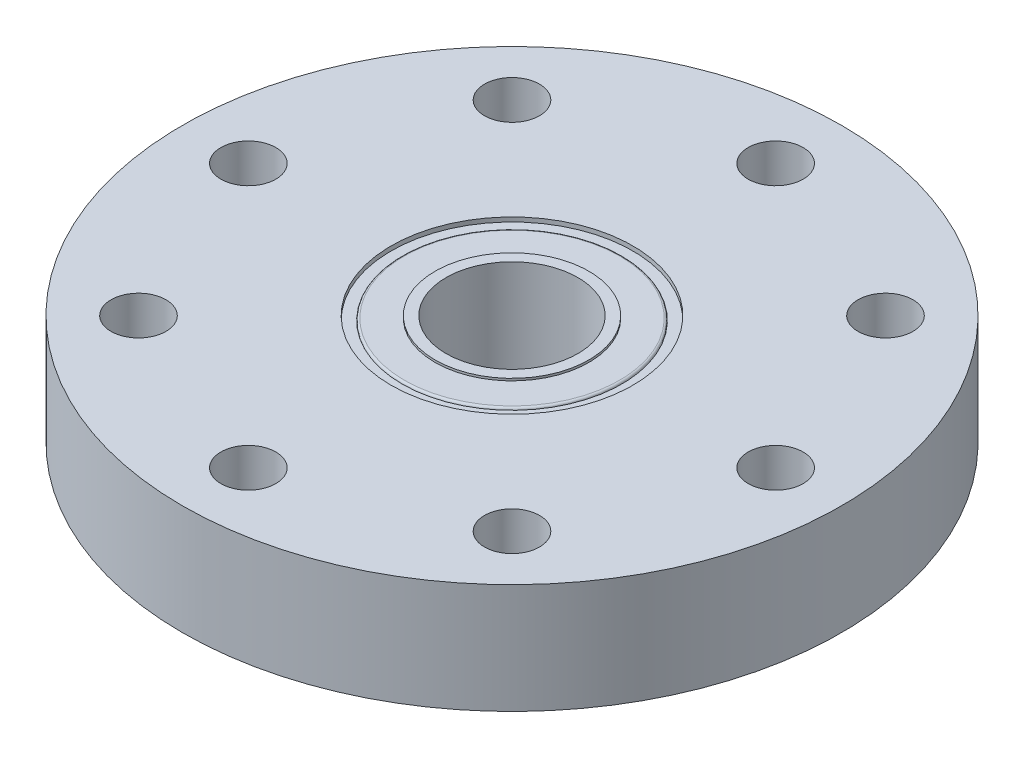
ISO-10303-21;
HEADER;
FILE_DESCRIPTION(('STEP AP214'),'2;1');
FILE_NAME('part.step','',(''),(''),'','','');
FILE_SCHEMA(('AUTOMOTIVE_DESIGN { 1 0 10303 214 1 1 1 1 }'));
ENDSEC;
DATA;
#1=APPLICATION_CONTEXT('core data for automotive mechanical design processes');
#2=APPLICATION_PROTOCOL_DEFINITION('international standard','automotive_design',2000,#1);
#3=PRODUCT_CONTEXT('',#1,'mechanical');
#4=PRODUCT('Part','Part','',(#3));
#5=PRODUCT_RELATED_PRODUCT_CATEGORY('part','',(#4));
#6=PRODUCT_DEFINITION_FORMATION('','',#4);
#7=PRODUCT_DEFINITION_CONTEXT('part definition',#1,'design');
#8=PRODUCT_DEFINITION('design','',#6,#7);
#9=PRODUCT_DEFINITION_SHAPE('','',#8);
#10=(LENGTH_UNIT() NAMED_UNIT(*) SI_UNIT(.MILLI.,.METRE.));
#11=(NAMED_UNIT(*) PLANE_ANGLE_UNIT() SI_UNIT($,.RADIAN.));
#12=(NAMED_UNIT(*) SI_UNIT($,.STERADIAN.) SOLID_ANGLE_UNIT());
#13=UNCERTAINTY_MEASURE_WITH_UNIT(LENGTH_MEASURE(1.E-05),#10,'distance_accuracy_value','');
#14=(GEOMETRIC_REPRESENTATION_CONTEXT(3) GLOBAL_UNCERTAINTY_ASSIGNED_CONTEXT((#13)) GLOBAL_UNIT_ASSIGNED_CONTEXT((#10,
#11,#12)) REPRESENTATION_CONTEXT('',''));
#15=CARTESIAN_POINT('',(0.,0.,0.));
#16=DIRECTION('',(0.,0.,1.));
#17=DIRECTION('',(1.,0.,0.));
#18=AXIS2_PLACEMENT_3D('',#15,#16,#17);
#19=CARTESIAN_POINT('',(0.,0.,0.));
#20=DIRECTION('',(0.,1.,0.));
#21=DIRECTION('',(0.,0.,1.));
#22=AXIS2_PLACEMENT_3D('',#19,#20,#21);
#23=PLANE('',#22);
#24=CARTESIAN_POINT('',(0.,0.,0.));
#25=DIRECTION('',(0.,1.,0.));
#26=DIRECTION('',(0.,0.,1.));
#27=AXIS2_PLACEMENT_3D('',#24,#25,#26);
#28=CIRCLE('',#27,3.);
#29=CARTESIAN_POINT('',(0.,0.,3.));
#30=VERTEX_POINT('',#29);
#31=EDGE_CURVE('E72',#30,#30,#28,.T.);
#32=ORIENTED_EDGE('',*,*,#31,.T.);
#33=EDGE_LOOP('',(#32));
#34=FACE_BOUND('',#33,.T.);
#35=CARTESIAN_POINT('',(0.,0.,0.));
#36=DIRECTION('',(0.,-1.,0.));
#37=DIRECTION('',(0.,0.,-1.));
#38=AXIS2_PLACEMENT_3D('',#35,#36,#37);
#39=CIRCLE('',#38,3.5);
#40=CARTESIAN_POINT('',(0.,0.,-3.5));
#41=VERTEX_POINT('',#40);
#42=EDGE_CURVE('E123',#41,#41,#39,.T.);
#43=ORIENTED_EDGE('',*,*,#42,.T.);
#44=EDGE_LOOP('',(#43));
#45=FACE_BOUND('',#44,.T.);
#46=ADVANCED_FACE('F33',(#34,#45),#23,.F.);
#47=CARTESIAN_POINT('',(0.,5.,0.));
#48=DIRECTION('',(0.,1.,0.));
#49=DIRECTION('',(0.,0.,1.));
#50=AXIS2_PLACEMENT_3D('',#47,#48,#49);
#51=PLANE('',#50);
#52=CARTESIAN_POINT('',(0.,5.,0.));
#53=DIRECTION('',(0.,1.,0.));
#54=DIRECTION('',(0.,0.,1.));
#55=AXIS2_PLACEMENT_3D('',#52,#53,#54);
#56=CIRCLE('',#55,3.);
#57=CARTESIAN_POINT('',(0.,5.,3.));
#58=VERTEX_POINT('',#57);
#59=EDGE_CURVE('E69',#58,#58,#56,.T.);
#60=ORIENTED_EDGE('',*,*,#59,.F.);
#61=EDGE_LOOP('',(#60));
#62=FACE_BOUND('',#61,.T.);
#63=CARTESIAN_POINT('',(0.,5.,0.));
#64=DIRECTION('',(0.,1.,0.));
#65=DIRECTION('',(0.,0.,1.));
#66=AXIS2_PLACEMENT_3D('',#63,#64,#65);
#67=CIRCLE('',#66,3.5);
#68=CARTESIAN_POINT('',(0.,5.,3.5));
#69=VERTEX_POINT('',#68);
#70=EDGE_CURVE('E117',#69,#69,#67,.T.);
#71=ORIENTED_EDGE('',*,*,#70,.T.);
#72=EDGE_LOOP('',(#71));
#73=FACE_BOUND('',#72,.T.);
#74=ADVANCED_FACE('F195',(#62,#73),#51,.T.);
#75=CARTESIAN_POINT('',(0.,5.,0.));
#76=DIRECTION('',(0.,1.,0.));
#77=DIRECTION('',(0.,0.,1.));
#78=AXIS2_PLACEMENT_3D('',#75,#76,#77);
#79=CIRCLE('',#78,5.5);
#80=CARTESIAN_POINT('',(0.,5.,5.5));
#81=VERTEX_POINT('',#80);
#82=EDGE_CURVE('E108',#81,#81,#79,.T.);
#83=ORIENTED_EDGE('',*,*,#82,.F.);
#84=EDGE_LOOP('',(#83));
#85=FACE_BOUND('',#84,.T.);
#86=CARTESIAN_POINT('',(-8.49999999999999,5.,8.50000000000049));
#87=DIRECTION('',(0.,1.,0.));
#88=DIRECTION('',(0.,0.,1.));
#89=AXIS2_PLACEMENT_3D('',#86,#87,#88);
#90=CIRCLE('',#89,1.25);
#91=CARTESIAN_POINT('',(-8.49999999999999,5.,9.75000000000049));
#92=VERTEX_POINT('',#91);
#93=EDGE_CURVE('E93',#92,#92,#90,.T.);
#94=ORIENTED_EDGE('',*,*,#93,.F.);
#95=EDGE_LOOP('',(#94));
#96=FACE_BOUND('',#95,.T.);
#97=CARTESIAN_POINT('',(8.5,5.,-8.49999999999952));
#98=DIRECTION('',(0.,1.,0.));
#99=DIRECTION('',(0.,0.,1.));
#100=AXIS2_PLACEMENT_3D('',#97,#98,#99);
#101=CIRCLE('',#100,1.25);
#102=CARTESIAN_POINT('',(8.5,5.,-7.24999999999952));
#103=VERTEX_POINT('',#102);
#104=EDGE_CURVE('E81',#103,#103,#101,.T.);
#105=ORIENTED_EDGE('',*,*,#104,.F.);
#106=EDGE_LOOP('',(#105));
#107=FACE_BOUND('',#106,.T.);
#108=CARTESIAN_POINT('',(0.,5.,12.));
#109=DIRECTION('',(0.,1.,0.));
#110=DIRECTION('',(0.,0.,1.));
#111=AXIS2_PLACEMENT_3D('',#108,#109,#110);
#112=CIRCLE('',#111,1.25);
#113=CARTESIAN_POINT('',(0.,5.,13.25));
#114=VERTEX_POINT('',#113);
#115=EDGE_CURVE('E57',#114,#114,#112,.T.);
#116=ORIENTED_EDGE('',*,*,#115,.F.);
#117=EDGE_LOOP('',(#116));
#118=FACE_BOUND('',#117,.T.);
#119=CARTESIAN_POINT('',(0.,5.,0.));
#120=DIRECTION('',(0.,1.,0.));
#121=DIRECTION('',(0.,0.,1.));
#122=AXIS2_PLACEMENT_3D('',#119,#120,#121);
#123=CIRCLE('',#122,15.);
#124=CARTESIAN_POINT('',(0.,5.,15.));
#125=VERTEX_POINT('',#124);
#126=EDGE_CURVE('E44',#125,#125,#123,.T.);
#127=ORIENTED_EDGE('',*,*,#126,.T.);
#128=EDGE_LOOP('',(#127));
#129=FACE_BOUND('',#128,.T.);
#130=CARTESIAN_POINT('',(0.,5.,-12.));
#131=DIRECTION('',(0.,1.,0.));
#132=DIRECTION('',(0.,0.,1.));
#133=AXIS2_PLACEMENT_3D('',#130,#131,#132);
#134=CIRCLE('',#133,1.25);
#135=CARTESIAN_POINT('',(0.,5.,-10.75));
#136=VERTEX_POINT('',#135);
#137=EDGE_CURVE('E52',#136,#136,#134,.T.);
#138=ORIENTED_EDGE('',*,*,#137,.F.);
#139=EDGE_LOOP('',(#138));
#140=FACE_BOUND('',#139,.T.);
#141=CARTESIAN_POINT('',(-12.,5.,0.));
#142=DIRECTION('',(0.,1.,0.));
#143=DIRECTION('',(0.,0.,1.));
#144=AXIS2_PLACEMENT_3D('',#141,#142,#143);
#145=CIRCLE('',#144,1.25);
#146=CARTESIAN_POINT('',(-12.,5.,1.25));
#147=VERTEX_POINT('',#146);
#148=EDGE_CURVE('E63',#147,#147,#145,.T.);
#149=ORIENTED_EDGE('',*,*,#148,.F.);
#150=EDGE_LOOP('',(#149));
#151=FACE_BOUND('',#150,.T.);
#152=CARTESIAN_POINT('',(12.,5.,0.));
#153=DIRECTION('',(0.,1.,0.));
#154=DIRECTION('',(0.,0.,1.));
#155=AXIS2_PLACEMENT_3D('',#152,#153,#154);
#156=CIRCLE('',#155,1.25);
#157=CARTESIAN_POINT('',(12.,5.,1.25));
#158=VERTEX_POINT('',#157);
#159=EDGE_CURVE('E75',#158,#158,#156,.T.);
#160=ORIENTED_EDGE('',*,*,#159,.F.);
#161=EDGE_LOOP('',(#160));
#162=FACE_BOUND('',#161,.T.);
#163=CARTESIAN_POINT('',(8.50000000000001,5.,8.50000000000049));
#164=DIRECTION('',(0.,1.,0.));
#165=DIRECTION('',(0.,0.,1.));
#166=AXIS2_PLACEMENT_3D('',#163,#164,#165);
#167=CIRCLE('',#166,1.25);
#168=CARTESIAN_POINT('',(8.50000000000001,5.,9.75000000000049));
#169=VERTEX_POINT('',#168);
#170=EDGE_CURVE('E87',#169,#169,#167,.T.);
#171=ORIENTED_EDGE('',*,*,#170,.F.);
#172=EDGE_LOOP('',(#171));
#173=FACE_BOUND('',#172,.T.);
#174=CARTESIAN_POINT('',(-8.5,5.,-8.49999999999952));
#175=DIRECTION('',(0.,1.,0.));
#176=DIRECTION('',(0.,0.,1.));
#177=AXIS2_PLACEMENT_3D('',#174,#175,#176);
#178=CIRCLE('',#177,1.25);
#179=CARTESIAN_POINT('',(-8.5,5.,-7.24999999999952));
#180=VERTEX_POINT('',#179);
#181=EDGE_CURVE('E99',#180,#180,#178,.T.);
#182=ORIENTED_EDGE('',*,*,#181,.F.);
#183=EDGE_LOOP('',(#182));
#184=FACE_BOUND('',#183,.T.);
#185=ADVANCED_FACE('F158',(#85,#96,#107,#118,#129,#140,#151,#162,#173,#184),#51,.T.);
#186=CARTESIAN_POINT('',(0.,0.,0.));
#187=DIRECTION('',(0.,-1.,0.));
#188=DIRECTION('',(0.,0.,-1.));
#189=AXIS2_PLACEMENT_3D('',#186,#187,#188);
#190=CIRCLE('',#189,5.75);
#191=CARTESIAN_POINT('',(0.,0.,-5.75));
#192=VERTEX_POINT('',#191);
#193=EDGE_CURVE('E129',#192,#192,#190,.T.);
#194=ORIENTED_EDGE('',*,*,#193,.F.);
#195=EDGE_LOOP('',(#194));
#196=FACE_BOUND('',#195,.T.);
#197=CARTESIAN_POINT('',(0.,0.,0.));
#198=DIRECTION('',(0.,1.,0.));
#199=DIRECTION('',(0.,0.,1.));
#200=AXIS2_PLACEMENT_3D('',#197,#198,#199);
#201=CIRCLE('',#200,15.);
#202=CARTESIAN_POINT('',(0.,0.,15.));
#203=VERTEX_POINT('',#202);
#204=EDGE_CURVE('E48',#203,#203,#201,.T.);
#205=ORIENTED_EDGE('',*,*,#204,.F.);
#206=EDGE_LOOP('',(#205));
#207=FACE_BOUND('',#206,.T.);
#208=CARTESIAN_POINT('',(0.,0.,-12.));
#209=DIRECTION('',(0.,1.,0.));
#210=DIRECTION('',(0.,0.,1.));
#211=AXIS2_PLACEMENT_3D('',#208,#209,#210);
#212=CIRCLE('',#211,1.25);
#213=CARTESIAN_POINT('',(0.,0.,-10.75));
#214=VERTEX_POINT('',#213);
#215=EDGE_CURVE('E54',#214,#214,#212,.T.);
#216=ORIENTED_EDGE('',*,*,#215,.T.);
#217=EDGE_LOOP('',(#216));
#218=FACE_BOUND('',#217,.T.);
#219=CARTESIAN_POINT('',(0.,0.,12.));
#220=DIRECTION('',(0.,1.,0.));
#221=DIRECTION('',(0.,0.,1.));
#222=AXIS2_PLACEMENT_3D('',#219,#220,#221);
#223=CIRCLE('',#222,1.25);
#224=CARTESIAN_POINT('',(0.,0.,13.25));
#225=VERTEX_POINT('',#224);
#226=EDGE_CURVE('E60',#225,#225,#223,.T.);
#227=ORIENTED_EDGE('',*,*,#226,.T.);
#228=EDGE_LOOP('',(#227));
#229=FACE_BOUND('',#228,.T.);
#230=CARTESIAN_POINT('',(-12.,0.,0.));
#231=DIRECTION('',(0.,1.,0.));
#232=DIRECTION('',(0.,0.,1.));
#233=AXIS2_PLACEMENT_3D('',#230,#231,#232);
#234=CIRCLE('',#233,1.25);
#235=CARTESIAN_POINT('',(-12.,0.,1.25));
#236=VERTEX_POINT('',#235);
#237=EDGE_CURVE('E66',#236,#236,#234,.T.);
#238=ORIENTED_EDGE('',*,*,#237,.T.);
#239=EDGE_LOOP('',(#238));
#240=FACE_BOUND('',#239,.T.);
#241=CARTESIAN_POINT('',(12.,0.,0.));
#242=DIRECTION('',(0.,1.,0.));
#243=DIRECTION('',(0.,0.,1.));
#244=AXIS2_PLACEMENT_3D('',#241,#242,#243);
#245=CIRCLE('',#244,1.25);
#246=CARTESIAN_POINT('',(12.,0.,1.25));
#247=VERTEX_POINT('',#246);
#248=EDGE_CURVE('E78',#247,#247,#245,.T.);
#249=ORIENTED_EDGE('',*,*,#248,.T.);
#250=EDGE_LOOP('',(#249));
#251=FACE_BOUND('',#250,.T.);
#252=CARTESIAN_POINT('',(8.5,0.,-8.49999999999952));
#253=DIRECTION('',(0.,1.,0.));
#254=DIRECTION('',(0.,0.,1.));
#255=AXIS2_PLACEMENT_3D('',#252,#253,#254);
#256=CIRCLE('',#255,1.25);
#257=CARTESIAN_POINT('',(8.5,0.,-7.24999999999952));
#258=VERTEX_POINT('',#257);
#259=EDGE_CURVE('E84',#258,#258,#256,.T.);
#260=ORIENTED_EDGE('',*,*,#259,.T.);
#261=EDGE_LOOP('',(#260));
#262=FACE_BOUND('',#261,.T.);
#263=CARTESIAN_POINT('',(8.50000000000001,0.,8.50000000000049));
#264=DIRECTION('',(0.,1.,0.));
#265=DIRECTION('',(0.,0.,1.));
#266=AXIS2_PLACEMENT_3D('',#263,#264,#265);
#267=CIRCLE('',#266,1.25);
#268=CARTESIAN_POINT('',(8.50000000000001,0.,9.75000000000049));
#269=VERTEX_POINT('',#268);
#270=EDGE_CURVE('E90',#269,#269,#267,.T.);
#271=ORIENTED_EDGE('',*,*,#270,.T.);
#272=EDGE_LOOP('',(#271));
#273=FACE_BOUND('',#272,.T.);
#274=CARTESIAN_POINT('',(-8.49999999999999,0.,8.50000000000049));
#275=DIRECTION('',(0.,1.,0.));
#276=DIRECTION('',(0.,0.,1.));
#277=AXIS2_PLACEMENT_3D('',#274,#275,#276);
#278=CIRCLE('',#277,1.25);
#279=CARTESIAN_POINT('',(-8.49999999999999,0.,9.75000000000049));
#280=VERTEX_POINT('',#279);
#281=EDGE_CURVE('E96',#280,#280,#278,.T.);
#282=ORIENTED_EDGE('',*,*,#281,.T.);
#283=EDGE_LOOP('',(#282));
#284=FACE_BOUND('',#283,.T.);
#285=CARTESIAN_POINT('',(-8.5,0.,-8.49999999999952));
#286=DIRECTION('',(0.,1.,0.));
#287=DIRECTION('',(0.,0.,1.));
#288=AXIS2_PLACEMENT_3D('',#285,#286,#287);
#289=CIRCLE('',#288,1.25);
#290=CARTESIAN_POINT('',(-8.5,0.,-7.24999999999952));
#291=VERTEX_POINT('',#290);
#292=EDGE_CURVE('E102',#291,#291,#289,.T.);
#293=ORIENTED_EDGE('',*,*,#292,.T.);
#294=EDGE_LOOP('',(#293));
#295=FACE_BOUND('',#294,.T.);
#296=ADVANCED_FACE('F154',(#196,#207,#218,#229,#240,#251,#262,#273,#284,#295),#23,.F.);
#297=CARTESIAN_POINT('',(0.,5.,0.));
#298=DIRECTION('',(0.,-1.,0.));
#299=DIRECTION('',(0.,0.,-1.));
#300=AXIS2_PLACEMENT_3D('',#297,#298,#299);
#301=CYLINDRICAL_SURFACE('',#300,15.);
#302=ORIENTED_EDGE('',*,*,#126,.F.);
#303=EDGE_LOOP('',(#302));
#304=FACE_BOUND('',#303,.T.);
#305=ORIENTED_EDGE('',*,*,#204,.T.);
#306=EDGE_LOOP('',(#305));
#307=FACE_BOUND('',#306,.T.);
#308=ADVANCED_FACE('F157',(#304,#307),#301,.T.);
#309=CARTESIAN_POINT('',(0.,5.,-12.));
#310=DIRECTION('',(0.,-1.,0.));
#311=DIRECTION('',(0.,0.,-1.));
#312=AXIS2_PLACEMENT_3D('',#309,#310,#311);
#313=CYLINDRICAL_SURFACE('',#312,1.25);
#314=ORIENTED_EDGE('',*,*,#137,.T.);
#315=EDGE_LOOP('',(#314));
#316=FACE_BOUND('',#315,.T.);
#317=ORIENTED_EDGE('',*,*,#215,.F.);
#318=EDGE_LOOP('',(#317));
#319=FACE_BOUND('',#318,.T.);
#320=ADVANCED_FACE('F206',(#316,#319),#313,.F.);
#321=CARTESIAN_POINT('',(0.,5.,12.));
#322=DIRECTION('',(0.,-1.,0.));
#323=DIRECTION('',(0.,0.,-1.));
#324=AXIS2_PLACEMENT_3D('',#321,#322,#323);
#325=CYLINDRICAL_SURFACE('',#324,1.25);
#326=ORIENTED_EDGE('',*,*,#115,.T.);
#327=EDGE_LOOP('',(#326));
#328=FACE_BOUND('',#327,.T.);
#329=ORIENTED_EDGE('',*,*,#226,.F.);
#330=EDGE_LOOP('',(#329));
#331=FACE_BOUND('',#330,.T.);
#332=ADVANCED_FACE('F267',(#328,#331),#325,.F.);
#333=CARTESIAN_POINT('',(-12.,5.,0.));
#334=DIRECTION('',(0.,-1.,0.));
#335=DIRECTION('',(0.,0.,-1.));
#336=AXIS2_PLACEMENT_3D('',#333,#334,#335);
#337=CYLINDRICAL_SURFACE('',#336,1.25);
#338=ORIENTED_EDGE('',*,*,#148,.T.);
#339=EDGE_LOOP('',(#338));
#340=FACE_BOUND('',#339,.T.);
#341=ORIENTED_EDGE('',*,*,#237,.F.);
#342=EDGE_LOOP('',(#341));
#343=FACE_BOUND('',#342,.T.);
#344=ADVANCED_FACE('F263',(#340,#343),#337,.F.);
#345=CARTESIAN_POINT('',(0.,5.,0.));
#346=DIRECTION('',(0.,-1.,0.));
#347=DIRECTION('',(0.,0.,-1.));
#348=AXIS2_PLACEMENT_3D('',#345,#346,#347);
#349=CYLINDRICAL_SURFACE('',#348,3.);
#350=ORIENTED_EDGE('',*,*,#59,.T.);
#351=EDGE_LOOP('',(#350));
#352=FACE_BOUND('',#351,.T.);
#353=ORIENTED_EDGE('',*,*,#31,.F.);
#354=EDGE_LOOP('',(#353));
#355=FACE_BOUND('',#354,.T.);
#356=ADVANCED_FACE('F259',(#352,#355),#349,.F.);
#357=CARTESIAN_POINT('',(12.,5.,0.));
#358=DIRECTION('',(0.,-1.,0.));
#359=DIRECTION('',(0.,0.,-1.));
#360=AXIS2_PLACEMENT_3D('',#357,#358,#359);
#361=CYLINDRICAL_SURFACE('',#360,1.25);
#362=ORIENTED_EDGE('',*,*,#159,.T.);
#363=EDGE_LOOP('',(#362));
#364=FACE_BOUND('',#363,.T.);
#365=ORIENTED_EDGE('',*,*,#248,.F.);
#366=EDGE_LOOP('',(#365));
#367=FACE_BOUND('',#366,.T.);
#368=ADVANCED_FACE('F253',(#364,#367),#361,.F.);
#369=CARTESIAN_POINT('',(8.5,5.,-8.49999999999952));
#370=DIRECTION('',(0.,-1.,0.));
#371=DIRECTION('',(0.,0.,-1.));
#372=AXIS2_PLACEMENT_3D('',#369,#370,#371);
#373=CYLINDRICAL_SURFACE('',#372,1.25);
#374=ORIENTED_EDGE('',*,*,#104,.T.);
#375=EDGE_LOOP('',(#374));
#376=FACE_BOUND('',#375,.T.);
#377=ORIENTED_EDGE('',*,*,#259,.F.);
#378=EDGE_LOOP('',(#377));
#379=FACE_BOUND('',#378,.T.);
#380=ADVANCED_FACE('F248',(#376,#379),#373,.F.);
#381=CARTESIAN_POINT('',(8.50000000000001,5.,8.50000000000049));
#382=DIRECTION('',(0.,-1.,0.));
#383=DIRECTION('',(0.,0.,-1.));
#384=AXIS2_PLACEMENT_3D('',#381,#382,#383);
#385=CYLINDRICAL_SURFACE('',#384,1.25);
#386=ORIENTED_EDGE('',*,*,#170,.T.);
#387=EDGE_LOOP('',(#386));
#388=FACE_BOUND('',#387,.T.);
#389=ORIENTED_EDGE('',*,*,#270,.F.);
#390=EDGE_LOOP('',(#389));
#391=FACE_BOUND('',#390,.T.);
#392=ADVANCED_FACE('F191',(#388,#391),#385,.F.);
#393=CARTESIAN_POINT('',(-8.49999999999999,5.,8.50000000000049));
#394=DIRECTION('',(0.,-1.,0.));
#395=DIRECTION('',(0.,0.,-1.));
#396=AXIS2_PLACEMENT_3D('',#393,#394,#395);
#397=CYLINDRICAL_SURFACE('',#396,1.25);
#398=ORIENTED_EDGE('',*,*,#93,.T.);
#399=EDGE_LOOP('',(#398));
#400=FACE_BOUND('',#399,.T.);
#401=ORIENTED_EDGE('',*,*,#281,.F.);
#402=EDGE_LOOP('',(#401));
#403=FACE_BOUND('',#402,.T.);
#404=ADVANCED_FACE('F181',(#400,#403),#397,.F.);
#405=CARTESIAN_POINT('',(-8.5,5.,-8.49999999999952));
#406=DIRECTION('',(0.,-1.,0.));
#407=DIRECTION('',(0.,0.,-1.));
#408=AXIS2_PLACEMENT_3D('',#405,#406,#407);
#409=CYLINDRICAL_SURFACE('',#408,1.25);
#410=ORIENTED_EDGE('',*,*,#181,.T.);
#411=EDGE_LOOP('',(#410));
#412=FACE_BOUND('',#411,.T.);
#413=ORIENTED_EDGE('',*,*,#292,.F.);
#414=EDGE_LOOP('',(#413));
#415=FACE_BOUND('',#414,.T.);
#416=ADVANCED_FACE('F178',(#412,#415),#409,.F.);
#417=CARTESIAN_POINT('',(0.,4.8,0.));
#418=DIRECTION('',(0.,1.,0.));
#419=DIRECTION('',(0.,0.,1.));
#420=AXIS2_PLACEMENT_3D('',#417,#418,#419);
#421=CYLINDRICAL_SURFACE('',#420,5.5);
#422=CARTESIAN_POINT('',(0.,4.8,0.));
#423=DIRECTION('',(0.,1.,0.));
#424=DIRECTION('',(0.,0.,1.));
#425=AXIS2_PLACEMENT_3D('',#422,#423,#424);
#426=CIRCLE('',#425,5.5);
#427=CARTESIAN_POINT('',(0.,4.8,5.5));
#428=VERTEX_POINT('',#427);
#429=EDGE_CURVE('E105',#428,#428,#426,.T.);
#430=ORIENTED_EDGE('',*,*,#429,.F.);
#431=EDGE_LOOP('',(#430));
#432=FACE_BOUND('',#431,.T.);
#433=ORIENTED_EDGE('',*,*,#82,.T.);
#434=EDGE_LOOP('',(#433));
#435=FACE_BOUND('',#434,.T.);
#436=ADVANCED_FACE('F180',(#432,#435),#421,.F.);
#437=CARTESIAN_POINT('',(0.,4.8,0.));
#438=DIRECTION('',(0.,1.,0.));
#439=DIRECTION('',(0.,0.,1.));
#440=AXIS2_PLACEMENT_3D('',#437,#438,#439);
#441=PLANE('',#440);
#442=CARTESIAN_POINT('',(0.,4.8,0.));
#443=DIRECTION('',(0.,1.,0.));
#444=DIRECTION('',(0.,0.,1.));
#445=AXIS2_PLACEMENT_3D('',#442,#443,#444);
#446=CIRCLE('',#445,5.);
#447=CARTESIAN_POINT('',(0.,4.8,5.));
#448=VERTEX_POINT('',#447);
#449=EDGE_CURVE('E111',#448,#448,#446,.T.);
#450=ORIENTED_EDGE('',*,*,#449,.F.);
#451=EDGE_LOOP('',(#450));
#452=FACE_BOUND('',#451,.T.);
#453=ORIENTED_EDGE('',*,*,#429,.T.);
#454=EDGE_LOOP('',(#453));
#455=FACE_BOUND('',#454,.T.);
#456=ADVANCED_FACE('F188',(#452,#455),#441,.T.);
#457=CARTESIAN_POINT('',(0.,4.9,0.));
#458=DIRECTION('',(0.,1.,0.));
#459=DIRECTION('',(0.,0.,1.));
#460=AXIS2_PLACEMENT_3D('',#457,#458,#459);
#461=CYLINDRICAL_SURFACE('',#460,3.5);
#462=CARTESIAN_POINT('',(0.,4.9,0.));
#463=DIRECTION('',(0.,1.,0.));
#464=DIRECTION('',(0.,0.,1.));
#465=AXIS2_PLACEMENT_3D('',#462,#463,#464);
#466=CIRCLE('',#465,3.5);
#467=CARTESIAN_POINT('',(0.,4.9,3.5));
#468=VERTEX_POINT('',#467);
#469=EDGE_CURVE('E112',#468,#468,#466,.T.);
#470=ORIENTED_EDGE('',*,*,#469,.T.);
#471=EDGE_LOOP('',(#470));
#472=FACE_BOUND('',#471,.T.);
#473=ORIENTED_EDGE('',*,*,#70,.F.);
#474=EDGE_LOOP('',(#473));
#475=FACE_BOUND('',#474,.T.);
#476=ADVANCED_FACE('F220',(#472,#475),#461,.T.);
#477=CARTESIAN_POINT('',(0.,4.9,0.));
#478=DIRECTION('',(0.,1.,0.));
#479=DIRECTION('',(0.,0.,1.));
#480=AXIS2_PLACEMENT_3D('',#477,#478,#479);
#481=PLANE('',#480);
#482=CARTESIAN_POINT('',(0.,4.9,0.));
#483=DIRECTION('',(0.,1.,0.));
#484=DIRECTION('',(0.,0.,1.));
#485=AXIS2_PLACEMENT_3D('',#482,#483,#484);
#486=CIRCLE('',#485,4.9);
#487=CARTESIAN_POINT('',(0.,4.9,4.9));
#488=VERTEX_POINT('',#487);
#489=EDGE_CURVE('E10',#488,#488,#486,.T.);
#490=ORIENTED_EDGE('',*,*,#489,.T.);
#491=EDGE_LOOP('',(#490));
#492=FACE_BOUND('',#491,.T.);
#493=ORIENTED_EDGE('',*,*,#469,.F.);
#494=EDGE_LOOP('',(#493));
#495=FACE_BOUND('',#494,.T.);
#496=ADVANCED_FACE('F345',(#492,#495),#481,.T.);
#497=CARTESIAN_POINT('',(0.,0.1,0.));
#498=DIRECTION('',(0.,-1.,0.));
#499=DIRECTION('',(0.,0.,-1.));
#500=AXIS2_PLACEMENT_3D('',#497,#498,#499);
#501=CYLINDRICAL_SURFACE('',#500,3.5);
#502=CARTESIAN_POINT('',(0.,0.1,0.));
#503=DIRECTION('',(0.,-1.,0.));
#504=DIRECTION('',(0.,0.,-1.));
#505=AXIS2_PLACEMENT_3D('',#502,#503,#504);
#506=CIRCLE('',#505,3.5);
#507=CARTESIAN_POINT('',(0.,0.1,-3.5));
#508=VERTEX_POINT('',#507);
#509=EDGE_CURVE('E120',#508,#508,#506,.T.);
#510=ORIENTED_EDGE('',*,*,#509,.T.);
#511=EDGE_LOOP('',(#510));
#512=FACE_BOUND('',#511,.T.);
#513=ORIENTED_EDGE('',*,*,#42,.F.);
#514=EDGE_LOOP('',(#513));
#515=FACE_BOUND('',#514,.T.);
#516=ADVANCED_FACE('F359',(#512,#515),#501,.T.);
#517=CARTESIAN_POINT('',(0.,0.1,0.));
#518=DIRECTION('',(0.,-1.,0.));
#519=DIRECTION('',(0.,0.,-1.));
#520=AXIS2_PLACEMENT_3D('',#517,#518,#519);
#521=PLANE('',#520);
#522=CARTESIAN_POINT('',(0.,0.1,0.));
#523=DIRECTION('',(0.,-1.,0.));
#524=DIRECTION('',(0.,0.,-1.));
#525=AXIS2_PLACEMENT_3D('',#522,#523,#524);
#526=CIRCLE('',#525,4.9);
#527=CARTESIAN_POINT('',(0.,0.1,-4.9));
#528=VERTEX_POINT('',#527);
#529=EDGE_CURVE('E40',#528,#528,#526,.T.);
#530=ORIENTED_EDGE('',*,*,#529,.T.);
#531=EDGE_LOOP('',(#530));
#532=FACE_BOUND('',#531,.T.);
#533=ORIENTED_EDGE('',*,*,#509,.F.);
#534=EDGE_LOOP('',(#533));
#535=FACE_BOUND('',#534,.T.);
#536=ADVANCED_FACE('F150',(#532,#535),#521,.T.);
#537=CARTESIAN_POINT('',(0.,0.2,0.));
#538=DIRECTION('',(0.,-1.,0.));
#539=DIRECTION('',(0.,0.,-1.));
#540=AXIS2_PLACEMENT_3D('',#537,#538,#539);
#541=CYLINDRICAL_SURFACE('',#540,5.75);
#542=CARTESIAN_POINT('',(0.,0.2,0.));
#543=DIRECTION('',(0.,-1.,0.));
#544=DIRECTION('',(0.,0.,-1.));
#545=AXIS2_PLACEMENT_3D('',#542,#543,#544);
#546=CIRCLE('',#545,5.75);
#547=CARTESIAN_POINT('',(0.,0.2,-5.75));
#548=VERTEX_POINT('',#547);
#549=EDGE_CURVE('E126',#548,#548,#546,.T.);
#550=ORIENTED_EDGE('',*,*,#549,.F.);
#551=EDGE_LOOP('',(#550));
#552=FACE_BOUND('',#551,.T.);
#553=ORIENTED_EDGE('',*,*,#193,.T.);
#554=EDGE_LOOP('',(#553));
#555=FACE_BOUND('',#554,.T.);
#556=ADVANCED_FACE('F144',(#552,#555),#541,.F.);
#557=CARTESIAN_POINT('',(0.,0.2,0.));
#558=DIRECTION('',(0.,-1.,0.));
#559=DIRECTION('',(0.,0.,-1.));
#560=AXIS2_PLACEMENT_3D('',#557,#558,#559);
#561=PLANE('',#560);
#562=CARTESIAN_POINT('',(0.,0.2,0.));
#563=DIRECTION('',(0.,-1.,0.));
#564=DIRECTION('',(0.,0.,-1.));
#565=AXIS2_PLACEMENT_3D('',#562,#563,#564);
#566=CIRCLE('',#565,5.);
#567=CARTESIAN_POINT('',(0.,0.2,-5.));
#568=VERTEX_POINT('',#567);
#569=EDGE_CURVE('E132',#568,#568,#566,.T.);
#570=ORIENTED_EDGE('',*,*,#569,.F.);
#571=EDGE_LOOP('',(#570));
#572=FACE_BOUND('',#571,.T.);
#573=ORIENTED_EDGE('',*,*,#549,.T.);
#574=EDGE_LOOP('',(#573));
#575=FACE_BOUND('',#574,.T.);
#576=ADVANCED_FACE('F141',(#572,#575),#561,.T.);
#577=CARTESIAN_POINT('',(0.,0.2,0.));
#578=DIRECTION('',(0.,-1.,0.));
#579=DIRECTION('',(0.,0.,-1.));
#580=AXIS2_PLACEMENT_3D('',#577,#578,#579);
#581=TOROIDAL_SURFACE('',#580,4.9,0.1);
#582=ORIENTED_EDGE('',*,*,#569,.T.);
#583=EDGE_LOOP('',(#582));
#584=FACE_BOUND('',#583,.T.);
#585=ORIENTED_EDGE('',*,*,#529,.F.);
#586=EDGE_LOOP('',(#585));
#587=FACE_BOUND('',#586,.T.);
#588=ADVANCED_FACE('F138',(#584,#587),#581,.T.);
#589=CARTESIAN_POINT('',(0.,4.8,0.));
#590=DIRECTION('',(0.,1.,0.));
#591=DIRECTION('',(0.,0.,1.));
#592=AXIS2_PLACEMENT_3D('',#589,#590,#591);
#593=TOROIDAL_SURFACE('',#592,4.9,0.1);
#594=ORIENTED_EDGE('',*,*,#449,.T.);
#595=EDGE_LOOP('',(#594));
#596=FACE_BOUND('',#595,.T.);
#597=ORIENTED_EDGE('',*,*,#489,.F.);
#598=EDGE_LOOP('',(#597));
#599=FACE_BOUND('',#598,.T.);
#600=ADVANCED_FACE('F35',(#596,#599),#593,.T.);
#601=CLOSED_SHELL('',(#46,#74,#185,#296,#308,#320,#332,#344,#356,#368,#380,#392,#404,#416,#436,
#456,#476,#496,#516,#536,#556,#576,#588,#600));
#602=MANIFOLD_SOLID_BREP('B2',#601);
#603=ADVANCED_BREP_SHAPE_REPRESENTATION('',(#18,#602),#14);
#604=SHAPE_DEFINITION_REPRESENTATION(#9,#603);
ENDSEC;
END-ISO-10303-21;
